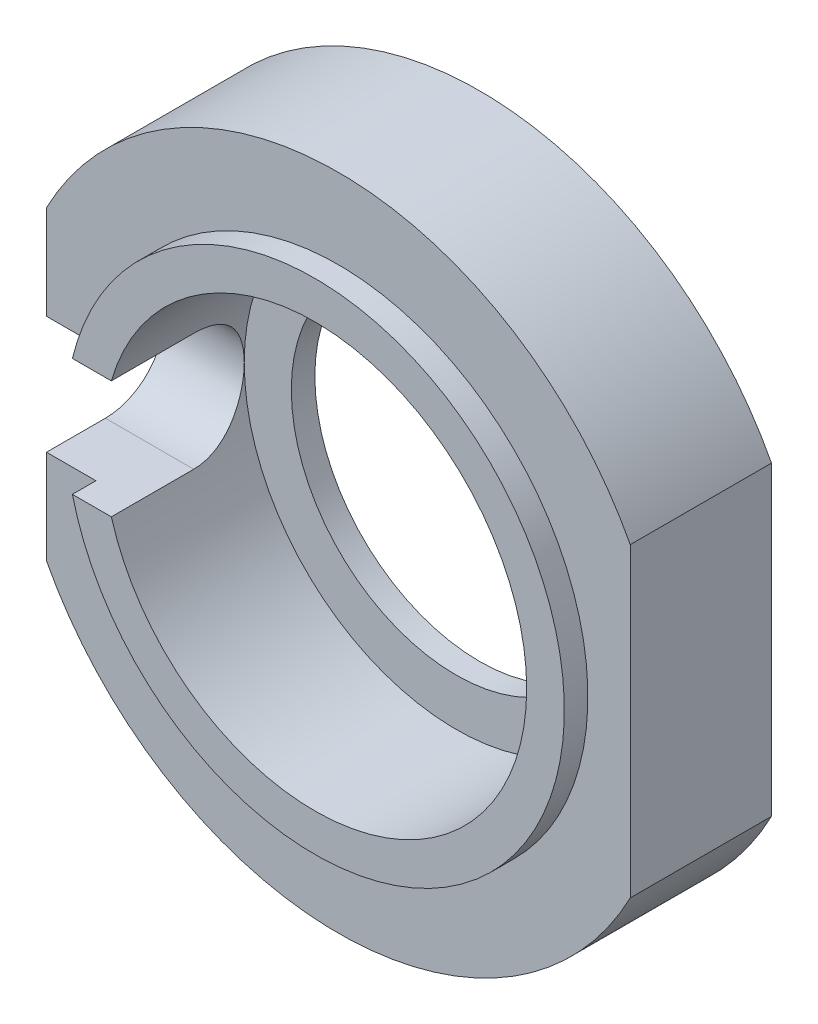
ISO-10303-21;
HEADER;
FILE_DESCRIPTION(('STEP AP214'),'2;1');
FILE_NAME('part.step','',(''),(''),'','','');
FILE_SCHEMA(('AUTOMOTIVE_DESIGN { 1 0 10303 214 1 1 1 1 }'));
ENDSEC;
DATA;
#1=APPLICATION_CONTEXT('core data for automotive mechanical design processes');
#2=APPLICATION_PROTOCOL_DEFINITION('international standard','automotive_design',2000,#1);
#3=PRODUCT_CONTEXT('',#1,'mechanical');
#4=PRODUCT('Part','Part','',(#3));
#5=PRODUCT_RELATED_PRODUCT_CATEGORY('part','',(#4));
#6=PRODUCT_DEFINITION_FORMATION('','',#4);
#7=PRODUCT_DEFINITION_CONTEXT('part definition',#1,'design');
#8=PRODUCT_DEFINITION('design','',#6,#7);
#9=PRODUCT_DEFINITION_SHAPE('','',#8);
#10=(LENGTH_UNIT() NAMED_UNIT(*) SI_UNIT(.MILLI.,.METRE.));
#11=(NAMED_UNIT(*) PLANE_ANGLE_UNIT() SI_UNIT($,.RADIAN.));
#12=(NAMED_UNIT(*) SI_UNIT($,.STERADIAN.) SOLID_ANGLE_UNIT());
#13=UNCERTAINTY_MEASURE_WITH_UNIT(LENGTH_MEASURE(1.E-05),#10,'distance_accuracy_value','');
#14=(GEOMETRIC_REPRESENTATION_CONTEXT(3) GLOBAL_UNCERTAINTY_ASSIGNED_CONTEXT((#13)) GLOBAL_UNIT_ASSIGNED_CONTEXT((#10,
#11,#12)) REPRESENTATION_CONTEXT('',''));
#15=CARTESIAN_POINT('',(0.,0.,0.));
#16=DIRECTION('',(0.,0.,1.));
#17=DIRECTION('',(1.,0.,0.));
#18=AXIS2_PLACEMENT_3D('',#15,#16,#17);
#19=CARTESIAN_POINT('',(0.,0.,-3.));
#20=DIRECTION('',(0.,0.,1.));
#21=DIRECTION('',(1.,0.,0.));
#22=AXIS2_PLACEMENT_3D('',#19,#20,#21);
#23=CYLINDRICAL_SURFACE('',#22,7.);
#24=DIRECTION('',(0.,0.,1.));
#25=VECTOR('',#24,1.);
#26=CARTESIAN_POINT('',(-6.2,3.24961536185439,-3.));
#27=LINE('',#26,#25);
#28=CARTESIAN_POINT('',(-6.2,3.24961536185439,0.));
#29=VERTEX_POINT('',#28);
#30=CARTESIAN_POINT('',(-6.2,3.24961536185439,-3.));
#31=VERTEX_POINT('',#30);
#32=EDGE_CURVE('E129',#29,#31,#27,.F.);
#33=ORIENTED_EDGE('',*,*,#32,.F.);
#34=CARTESIAN_POINT('',(0.,0.,0.));
#35=DIRECTION('',(0.,0.,1.));
#36=DIRECTION('',(1.,0.,0.));
#37=AXIS2_PLACEMENT_3D('',#34,#35,#36);
#38=CIRCLE('',#37,7.);
#39=CARTESIAN_POINT('',(6.2,3.24961536185438,0.));
#40=VERTEX_POINT('',#39);
#41=EDGE_CURVE('E165',#40,#29,#38,.T.);
#42=ORIENTED_EDGE('',*,*,#41,.F.);
#43=DIRECTION('',(0.,0.,1.));
#44=VECTOR('',#43,1.);
#45=CARTESIAN_POINT('',(6.2,3.24961536185438,-3.));
#46=LINE('',#45,#44);
#47=CARTESIAN_POINT('',(6.2,3.24961536185438,-3.));
#48=VERTEX_POINT('',#47);
#49=EDGE_CURVE('E73',#40,#48,#46,.F.);
#50=ORIENTED_EDGE('',*,*,#49,.T.);
#51=CARTESIAN_POINT('',(0.,0.,-3.));
#52=DIRECTION('',(0.,0.,1.));
#53=DIRECTION('',(1.,0.,0.));
#54=AXIS2_PLACEMENT_3D('',#51,#52,#53);
#55=CIRCLE('',#54,7.);
#56=EDGE_CURVE('E148',#48,#31,#55,.T.);
#57=ORIENTED_EDGE('',*,*,#56,.T.);
#58=EDGE_LOOP('',(#33,#42,#50,#57));
#59=FACE_BOUND('',#58,.T.);
#60=ADVANCED_FACE('F50',(#59),#23,.T.);
#61=DIRECTION('',(0.,0.,1.));
#62=VECTOR('',#61,1.);
#63=CARTESIAN_POINT('',(-6.2,-3.24961536185439,-3.));
#64=LINE('',#63,#62);
#65=CARTESIAN_POINT('',(-6.2,-3.24961536185438,-3.));
#66=VERTEX_POINT('',#65);
#67=CARTESIAN_POINT('',(-6.2,-3.24961536185438,0.));
#68=VERTEX_POINT('',#67);
#69=EDGE_CURVE('E141',#66,#68,#64,.T.);
#70=ORIENTED_EDGE('',*,*,#69,.F.);
#71=CARTESIAN_POINT('',(6.2,-3.24961536185439,-3.));
#72=VERTEX_POINT('',#71);
#73=EDGE_CURVE('E149',#66,#72,#55,.T.);
#74=ORIENTED_EDGE('',*,*,#73,.T.);
#75=DIRECTION('',(0.,0.,1.));
#76=VECTOR('',#75,1.);
#77=CARTESIAN_POINT('',(6.2,-3.24961536185439,-3.));
#78=LINE('',#77,#76);
#79=CARTESIAN_POINT('',(6.2,-3.24961536185439,0.));
#80=VERTEX_POINT('',#79);
#81=EDGE_CURVE('E222',#72,#80,#78,.T.);
#82=ORIENTED_EDGE('',*,*,#81,.T.);
#83=EDGE_CURVE('E156',#68,#80,#38,.T.);
#84=ORIENTED_EDGE('',*,*,#83,.F.);
#85=EDGE_LOOP('',(#70,#74,#82,#84));
#86=FACE_BOUND('',#85,.T.);
#87=ADVANCED_FACE('F255',(#86),#23,.T.);
#88=CARTESIAN_POINT('',(0.,0.,-3.));
#89=DIRECTION('',(0.,0.,1.));
#90=DIRECTION('',(1.,0.,0.));
#91=AXIS2_PLACEMENT_3D('',#88,#89,#90);
#92=PLANE('',#91);
#93=CARTESIAN_POINT('',(0.,0.,-3.));
#94=DIRECTION('',(0.,0.,-1.));
#95=DIRECTION('',(-1.,0.,0.));
#96=AXIS2_PLACEMENT_3D('',#93,#94,#95);
#97=CIRCLE('',#96,3.5);
#98=CARTESIAN_POINT('',(-3.5,0.,-3.));
#99=VERTEX_POINT('',#98);
#100=EDGE_CURVE('E181',#99,#99,#97,.T.);
#101=ORIENTED_EDGE('',*,*,#100,.F.);
#102=EDGE_LOOP('',(#101));
#103=FACE_BOUND('',#102,.T.);
#104=ORIENTED_EDGE('',*,*,#73,.F.);
#105=DIRECTION('',(0.,-1.,0.));
#106=VECTOR('',#105,1.);
#107=CARTESIAN_POINT('',(-6.2,12.06652293587,-3.));
#108=LINE('',#107,#106);
#109=EDGE_CURVE('E132',#31,#66,#108,.T.);
#110=ORIENTED_EDGE('',*,*,#109,.F.);
#111=ORIENTED_EDGE('',*,*,#56,.F.);
#112=DIRECTION('',(0.,-1.,0.));
#113=VECTOR('',#112,1.);
#114=CARTESIAN_POINT('',(6.2,12.7025152736224,-3.));
#115=LINE('',#114,#113);
#116=EDGE_CURVE('E140',#48,#72,#115,.T.);
#117=ORIENTED_EDGE('',*,*,#116,.T.);
#118=EDGE_LOOP('',(#104,#110,#111,#117));
#119=FACE_BOUND('',#118,.T.);
#120=ADVANCED_FACE('F146',(#103,#119),#92,.F.);
#121=CARTESIAN_POINT('',(0.,0.,0.));
#122=DIRECTION('',(0.,0.,1.));
#123=DIRECTION('',(1.,0.,0.));
#124=AXIS2_PLACEMENT_3D('',#121,#122,#123);
#125=PLANE('',#124);
#126=DIRECTION('',(0.,1.,0.));
#127=VECTOR('',#126,1.);
#128=CARTESIAN_POINT('',(-6.2,0.,0.));
#129=LINE('',#128,#127);
#130=CARTESIAN_POINT('',(-6.2,-1.25,0.));
#131=VERTEX_POINT('',#130);
#132=EDGE_CURVE('E226',#68,#131,#129,.T.);
#133=ORIENTED_EDGE('',*,*,#132,.F.);
#134=ORIENTED_EDGE('',*,*,#83,.T.);
#135=DIRECTION('',(0.,1.,0.));
#136=VECTOR('',#135,1.);
#137=CARTESIAN_POINT('',(6.2,0.,0.));
#138=LINE('',#137,#136);
#139=EDGE_CURVE('E59',#80,#40,#138,.T.);
#140=ORIENTED_EDGE('',*,*,#139,.T.);
#141=ORIENTED_EDGE('',*,*,#41,.T.);
#142=CARTESIAN_POINT('',(-6.2,1.25,0.));
#143=VERTEX_POINT('',#142);
#144=EDGE_CURVE('E135',#143,#29,#129,.T.);
#145=ORIENTED_EDGE('',*,*,#144,.F.);
#146=DIRECTION('',(-1.,0.,0.));
#147=VECTOR('',#146,1.);
#148=CARTESIAN_POINT('',(0.,1.25,0.));
#149=LINE('',#148,#147);
#150=CARTESIAN_POINT('',(-5.15048541401682,1.25,0.));
#151=VERTEX_POINT('',#150);
#152=EDGE_CURVE('E175',#151,#143,#149,.T.);
#153=ORIENTED_EDGE('',*,*,#152,.F.);
#154=CARTESIAN_POINT('',(0.,0.,0.));
#155=DIRECTION('',(0.,0.,1.));
#156=DIRECTION('',(1.,0.,0.));
#157=AXIS2_PLACEMENT_3D('',#154,#155,#156);
#158=CIRCLE('',#157,5.3);
#159=CARTESIAN_POINT('',(-5.15048541401682,-1.25,0.));
#160=VERTEX_POINT('',#159);
#161=EDGE_CURVE('E151',#160,#151,#158,.T.);
#162=ORIENTED_EDGE('',*,*,#161,.F.);
#163=DIRECTION('',(-1.,0.,0.));
#164=VECTOR('',#163,1.);
#165=CARTESIAN_POINT('',(0.,-1.25,0.));
#166=LINE('',#165,#164);
#167=EDGE_CURVE('E172',#160,#131,#166,.T.);
#168=ORIENTED_EDGE('',*,*,#167,.T.);
#169=EDGE_LOOP('',(#133,#134,#140,#141,#145,#153,#162,#168));
#170=FACE_BOUND('',#169,.T.);
#171=ADVANCED_FACE('F184',(#170),#125,.T.);
#172=CARTESIAN_POINT('',(0.,0.,0.5));
#173=DIRECTION('',(0.,0.,-1.));
#174=DIRECTION('',(-1.,0.,0.));
#175=AXIS2_PLACEMENT_3D('',#172,#173,#174);
#176=CYLINDRICAL_SURFACE('',#175,4.5);
#177=CARTESIAN_POINT('',(-4.32290411644765,-1.25,-1.25));
#178=CARTESIAN_POINT('',(-4.32290146436676,-1.250000576045,-1.28443902151534));
#179=CARTESIAN_POINT('',(-4.32331618408268,-1.24857583471195,-1.31886083039536));
#180=CARTESIAN_POINT('',(-4.32495310948487,-1.24289726955145,-1.3874442118807));
#181=CARTESIAN_POINT('',(-4.32617515519048,-1.23864400622614,-1.42160583468842));
#182=CARTESIAN_POINT('',(-4.33100149833611,-1.22170857228189,-1.5231684082525));
#183=CARTESIAN_POINT('',(-4.33576634319415,-1.20485043734851,-1.58986696249564));
#184=CARTESIAN_POINT('',(-4.34782862393349,-1.16056251821539,-1.71934348359845));
#185=CARTESIAN_POINT('',(-4.35512547838519,-1.13313516088422,-1.78212234664163));
#186=CARTESIAN_POINT('',(-4.37142497842244,-1.06852719338263,-1.90222678997382));
#187=CARTESIAN_POINT('',(-4.38042826125777,-1.03134293758884,-1.95955032096867));
#188=CARTESIAN_POINT('',(-4.39939714110305,-0.947208740400632,-2.0686303119187));
#189=CARTESIAN_POINT('',(-4.4093808433702,-0.900042882492583,-2.12021704718377));
#190=CARTESIAN_POINT('',(-4.42903068956963,-0.797744375711472,-2.21486290368673));
#191=CARTESIAN_POINT('',(-4.43869678111203,-0.742610420517771,-2.25792062389568));
#192=CARTESIAN_POINT('',(-4.4568262221146,-0.624748847501625,-2.33500318468976));
#193=CARTESIAN_POINT('',(-4.46526557805168,-0.561905279407677,-2.36885686402257));
#194=CARTESIAN_POINT('',(-4.47978037147462,-0.431147068581119,-2.42545066447839));
#195=CARTESIAN_POINT('',(-4.48585635069242,-0.363233592229249,-2.44819333276768));
#196=CARTESIAN_POINT('',(-4.49483154375068,-0.226043909478742,-2.48136530042189));
#197=CARTESIAN_POINT('',(-4.49780562679107,-0.156842976341786,-2.49208529277897));
#198=CARTESIAN_POINT('',(-4.50050434231718,-0.0175637350726412,-2.50182374718203));
#199=CARTESIAN_POINT('',(-4.50022949353404,0.0525144312139211,-2.50084407721993));
#200=CARTESIAN_POINT('',(-4.49651542268428,0.189527464729258,-2.48741219200865));
#201=CARTESIAN_POINT('',(-4.49316295627681,0.256495880174801,-2.47527449984516));
#202=CARTESIAN_POINT('',(-4.48377373992802,0.387404386211101,-2.4403811972799));
#203=CARTESIAN_POINT('',(-4.47773685771609,0.451344327406483,-2.41762506366747));
#204=CARTESIAN_POINT('',(-4.46353118905257,0.575167349566246,-2.36190872708191));
#205=CARTESIAN_POINT('',(-4.45534060663725,0.635000577901014,-2.32884351898761));
#206=CARTESIAN_POINT('',(-4.43770593865296,0.748373249601415,-2.25352937127713));
#207=CARTESIAN_POINT('',(-4.42826161351248,0.801911486391908,-2.211278675465));
#208=CARTESIAN_POINT('',(-4.40876934232228,0.903048023877687,-2.11714089157013));
#209=CARTESIAN_POINT('',(-4.39871176449087,0.950390721090147,-2.06498088801708));
#210=CARTESIAN_POINT('',(-4.37940385930509,1.03573266388548,-1.95334513077325));
#211=CARTESIAN_POINT('',(-4.37015375862718,1.07372929122919,-1.89386733403631));
#212=CARTESIAN_POINT('',(-4.35346480631467,1.13952154646574,-1.76868204304441));
#213=CARTESIAN_POINT('',(-4.34604045960407,1.16723631936365,-1.70293007972026));
#214=CARTESIAN_POINT('',(-4.33402454738315,1.21109743492695,-1.56747799244878));
#215=CARTESIAN_POINT('',(-4.329428707483,1.22726123919972,-1.49778400053626));
#216=CARTESIAN_POINT('',(-4.32533224221935,1.24157759886207,-1.39788311805461));
#217=CARTESIAN_POINT('',(-4.32442341010474,1.24473608920077,-1.36837911678992));
#218=CARTESIAN_POINT('',(-4.32320943811857,1.24894515709783,-1.30925491623904));
#219=CARTESIAN_POINT('',(-4.32290336202703,1.24999900369232,-1.2796349688701));
#220=CARTESIAN_POINT('',(-4.32290411644765,1.25,-1.25));
#221=B_SPLINE_CURVE_WITH_KNOTS('',3,(#177,#178,#179,#180,#181,#182,#183,#184,#185,#186,#187,
#188,#189,#190,#191,#192,#193,#194,#195,#196,#197,#198,#199,#200,#201,#202,#203,#204,#205,#206,
#207,#208,#209,#210,#211,#212,#213,#214,#215,#216,#217,#218,#219,#220),.UNSPECIFIED.,.F.,.F.,(4,
2,2,2,2,2,2,2,2,2,2,2,2,2,2,2,2,2,2,2,2,4),(0.,0.103251330397729,0.206482206525295,
0.412292932386806,0.618056428827713,0.823896917670529,1.03475400760892,1.24564570556978,
1.46022599591408,1.67475707125433,1.88398102562563,2.09317157532102,2.2966404702467,
2.50011939191108,2.70574260990256,2.91140517613004,3.12388242695943,3.33641913425316,
3.55059344766321,3.7644433047568,3.85343647289299,3.94229130462277),.UNSPECIFIED.);
#222=CARTESIAN_POINT('',(-4.50000000000113,4.31042943698656E-13,-2.50000000000406));
#223=VERTEX_POINT('',#222);
#224=CARTESIAN_POINT('',(-4.32290411644765,1.25,-1.25));
#225=VERTEX_POINT('',#224);
#226=EDGE_CURVE('E189',#223,#225,#221,.T.);
#227=ORIENTED_EDGE('',*,*,#226,.F.);
#228=CARTESIAN_POINT('',(0.,0.,-2.5));
#229=DIRECTION('',(0.,0.,-1.));
#230=DIRECTION('',(-1.,0.,0.));
#231=AXIS2_PLACEMENT_3D('',#228,#229,#230);
#232=CIRCLE('',#231,4.5);
#233=EDGE_CURVE('E180',#223,#223,#232,.T.);
#234=ORIENTED_EDGE('',*,*,#233,.T.);
#235=CARTESIAN_POINT('',(-4.32290411644765,-1.25,-1.25));
#236=VERTEX_POINT('',#235);
#237=EDGE_CURVE('E159',#236,#223,#221,.T.);
#238=ORIENTED_EDGE('',*,*,#237,.F.);
#239=DIRECTION('',(0.,0.,-1.));
#240=VECTOR('',#239,1.);
#241=CARTESIAN_POINT('',(-4.32290411644765,-1.25,0.5));
#242=LINE('',#241,#240);
#243=CARTESIAN_POINT('',(-4.32290411644765,-1.25,0.5));
#244=VERTEX_POINT('',#243);
#245=EDGE_CURVE('E205',#236,#244,#242,.F.);
#246=ORIENTED_EDGE('',*,*,#245,.T.);
#247=CARTESIAN_POINT('',(0.,0.,0.5));
#248=DIRECTION('',(0.,0.,1.));
#249=DIRECTION('',(1.,0.,0.));
#250=AXIS2_PLACEMENT_3D('',#247,#248,#249);
#251=CIRCLE('',#250,4.5);
#252=CARTESIAN_POINT('',(-4.32290411644765,1.25,0.5));
#253=VERTEX_POINT('',#252);
#254=EDGE_CURVE('E154',#244,#253,#251,.T.);
#255=ORIENTED_EDGE('',*,*,#254,.T.);
#256=DIRECTION('',(0.,0.,-1.));
#257=VECTOR('',#256,1.);
#258=CARTESIAN_POINT('',(-4.32290411644765,1.25,0.5));
#259=LINE('',#258,#257);
#260=EDGE_CURVE('E193',#225,#253,#259,.F.);
#261=ORIENTED_EDGE('',*,*,#260,.F.);
#262=EDGE_LOOP('',(#227,#234,#238,#246,#255,#261));
#263=FACE_BOUND('',#262,.T.);
#264=ADVANCED_FACE('F52',(#263),#176,.F.);
#265=CARTESIAN_POINT('',(0.,0.,0.5));
#266=DIRECTION('',(0.,0.,-1.));
#267=DIRECTION('',(-1.,0.,0.));
#268=AXIS2_PLACEMENT_3D('',#265,#266,#267);
#269=CYLINDRICAL_SURFACE('',#268,5.3);
#270=ORIENTED_EDGE('',*,*,#161,.T.);
#271=DIRECTION('',(0.,0.,-1.));
#272=VECTOR('',#271,1.);
#273=CARTESIAN_POINT('',(-5.15048541401682,1.25,0.5));
#274=LINE('',#273,#272);
#275=CARTESIAN_POINT('',(-5.15048541401682,1.25,0.5));
#276=VERTEX_POINT('',#275);
#277=EDGE_CURVE('E200',#151,#276,#274,.F.);
#278=ORIENTED_EDGE('',*,*,#277,.T.);
#279=CARTESIAN_POINT('',(0.,0.,0.5));
#280=DIRECTION('',(0.,0.,1.));
#281=DIRECTION('',(1.,0.,0.));
#282=AXIS2_PLACEMENT_3D('',#279,#280,#281);
#283=CIRCLE('',#282,5.3);
#284=CARTESIAN_POINT('',(-5.15048541401682,-1.25,0.5));
#285=VERTEX_POINT('',#284);
#286=EDGE_CURVE('E169',#285,#276,#283,.T.);
#287=ORIENTED_EDGE('',*,*,#286,.F.);
#288=DIRECTION('',(0.,0.,-1.));
#289=VECTOR('',#288,1.);
#290=CARTESIAN_POINT('',(-5.15048541401682,-1.25,0.5));
#291=LINE('',#290,#289);
#292=EDGE_CURVE('E211',#160,#285,#291,.F.);
#293=ORIENTED_EDGE('',*,*,#292,.F.);
#294=EDGE_LOOP('',(#270,#278,#287,#293));
#295=FACE_BOUND('',#294,.T.);
#296=ADVANCED_FACE('F266',(#295),#269,.T.);
#297=CARTESIAN_POINT('',(0.,0.,0.5));
#298=DIRECTION('',(0.,0.,1.));
#299=DIRECTION('',(1.,0.,0.));
#300=AXIS2_PLACEMENT_3D('',#297,#298,#299);
#301=PLANE('',#300);
#302=DIRECTION('',(-1.,0.,0.));
#303=VECTOR('',#302,1.);
#304=CARTESIAN_POINT('',(0.,1.25,0.5));
#305=LINE('',#304,#303);
#306=EDGE_CURVE('E197',#253,#276,#305,.T.);
#307=ORIENTED_EDGE('',*,*,#306,.F.);
#308=ORIENTED_EDGE('',*,*,#254,.F.);
#309=DIRECTION('',(-1.,0.,0.));
#310=VECTOR('',#309,1.);
#311=CARTESIAN_POINT('',(0.,-1.25,0.5));
#312=LINE('',#311,#310);
#313=EDGE_CURVE('E208',#244,#285,#312,.T.);
#314=ORIENTED_EDGE('',*,*,#313,.T.);
#315=ORIENTED_EDGE('',*,*,#286,.T.);
#316=EDGE_LOOP('',(#307,#308,#314,#315));
#317=FACE_BOUND('',#316,.T.);
#318=ADVANCED_FACE('F264',(#317),#301,.T.);
#319=CARTESIAN_POINT('',(-7.,1.25,-1.25));
#320=DIRECTION('',(0.,1.,0.));
#321=DIRECTION('',(0.,0.,1.));
#322=AXIS2_PLACEMENT_3D('',#319,#320,#321);
#323=PLANE('',#322);
#324=ORIENTED_EDGE('',*,*,#152,.T.);
#325=DIRECTION('',(0.,0.,-1.));
#326=VECTOR('',#325,1.);
#327=CARTESIAN_POINT('',(-6.2,1.25,-1.25));
#328=LINE('',#327,#326);
#329=CARTESIAN_POINT('',(-6.2,1.25,-1.25));
#330=VERTEX_POINT('',#329);
#331=EDGE_CURVE('E228',#143,#330,#328,.T.);
#332=ORIENTED_EDGE('',*,*,#331,.T.);
#333=DIRECTION('',(1.,0.,0.));
#334=VECTOR('',#333,1.);
#335=CARTESIAN_POINT('',(-7.,1.25,-1.25));
#336=LINE('',#335,#334);
#337=EDGE_CURVE('E215',#330,#225,#336,.T.);
#338=ORIENTED_EDGE('',*,*,#337,.T.);
#339=ORIENTED_EDGE('',*,*,#260,.T.);
#340=ORIENTED_EDGE('',*,*,#306,.T.);
#341=ORIENTED_EDGE('',*,*,#277,.F.);
#342=EDGE_LOOP('',(#324,#332,#338,#339,#340,#341));
#343=FACE_BOUND('',#342,.T.);
#344=ADVANCED_FACE('F231',(#343),#323,.F.);
#345=CARTESIAN_POINT('',(-7.,-1.25,-1.25));
#346=DIRECTION('',(0.,1.,0.));
#347=DIRECTION('',(0.,0.,1.));
#348=AXIS2_PLACEMENT_3D('',#345,#346,#347);
#349=PLANE('',#348);
#350=DIRECTION('',(0.,0.,-1.));
#351=VECTOR('',#350,1.);
#352=CARTESIAN_POINT('',(-6.2,-1.25,-1.25));
#353=LINE('',#352,#351);
#354=CARTESIAN_POINT('',(-6.2,-1.25,-1.25));
#355=VERTEX_POINT('',#354);
#356=EDGE_CURVE('E66',#131,#355,#353,.T.);
#357=ORIENTED_EDGE('',*,*,#356,.F.);
#358=ORIENTED_EDGE('',*,*,#167,.F.);
#359=ORIENTED_EDGE('',*,*,#292,.T.);
#360=ORIENTED_EDGE('',*,*,#313,.F.);
#361=ORIENTED_EDGE('',*,*,#245,.F.);
#362=DIRECTION('',(1.,0.,0.));
#363=VECTOR('',#362,1.);
#364=CARTESIAN_POINT('',(-7.,-1.25,-1.25));
#365=LINE('',#364,#363);
#366=EDGE_CURVE('E213',#355,#236,#365,.T.);
#367=ORIENTED_EDGE('',*,*,#366,.F.);
#368=EDGE_LOOP('',(#357,#358,#359,#360,#361,#367));
#369=FACE_BOUND('',#368,.T.);
#370=ADVANCED_FACE('F237',(#369),#349,.T.);
#371=CARTESIAN_POINT('',(-7.,0.,-1.25));
#372=DIRECTION('',(1.,0.,0.));
#373=DIRECTION('',(0.,0.,-1.));
#374=AXIS2_PLACEMENT_3D('',#371,#372,#373);
#375=CYLINDRICAL_SURFACE('',#374,1.25);
#376=ORIENTED_EDGE('',*,*,#337,.F.);
#377=CARTESIAN_POINT('',(-6.2,0.,-1.25));
#378=DIRECTION('',(1.,0.,0.));
#379=DIRECTION('',(0.,1.,0.));
#380=AXIS2_PLACEMENT_3D('',#377,#378,#379);
#381=CIRCLE('',#380,1.25);
#382=EDGE_CURVE('E12',#330,#355,#381,.F.);
#383=ORIENTED_EDGE('',*,*,#382,.T.);
#384=ORIENTED_EDGE('',*,*,#366,.T.);
#385=ORIENTED_EDGE('',*,*,#237,.T.);
#386=ORIENTED_EDGE('',*,*,#226,.T.);
#387=EDGE_LOOP('',(#376,#383,#384,#385,#386));
#388=FACE_BOUND('',#387,.T.);
#389=ADVANCED_FACE('F233',(#388),#375,.F.);
#390=CARTESIAN_POINT('',(0.,0.,-2.5));
#391=DIRECTION('',(0.,0.,-1.));
#392=DIRECTION('',(-1.,0.,0.));
#393=AXIS2_PLACEMENT_3D('',#390,#391,#392);
#394=PLANE('',#393);
#395=CARTESIAN_POINT('',(0.,0.,-2.5));
#396=DIRECTION('',(0.,0.,-1.));
#397=DIRECTION('',(-1.,0.,0.));
#398=AXIS2_PLACEMENT_3D('',#395,#396,#397);
#399=CIRCLE('',#398,3.5);
#400=CARTESIAN_POINT('',(-3.5,0.,-2.5));
#401=VERTEX_POINT('',#400);
#402=EDGE_CURVE('E178',#401,#401,#399,.T.);
#403=ORIENTED_EDGE('',*,*,#402,.T.);
#404=EDGE_LOOP('',(#403));
#405=FACE_BOUND('',#404,.T.);
#406=ORIENTED_EDGE('',*,*,#233,.F.);
#407=EDGE_LOOP('',(#406));
#408=FACE_BOUND('',#407,.T.);
#409=ADVANCED_FACE('F241',(#405,#408),#394,.F.);
#410=CARTESIAN_POINT('',(0.,0.,0.5));
#411=DIRECTION('',(0.,0.,-1.));
#412=DIRECTION('',(-1.,0.,0.));
#413=AXIS2_PLACEMENT_3D('',#410,#411,#412);
#414=CYLINDRICAL_SURFACE('',#413,3.5);
#415=ORIENTED_EDGE('',*,*,#100,.T.);
#416=EDGE_LOOP('',(#415));
#417=FACE_BOUND('',#416,.T.);
#418=ORIENTED_EDGE('',*,*,#402,.F.);
#419=EDGE_LOOP('',(#418));
#420=FACE_BOUND('',#419,.T.);
#421=ADVANCED_FACE('F243',(#417,#420),#414,.F.);
#422=CARTESIAN_POINT('',(6.2,12.7025152736224,0.5));
#423=DIRECTION('',(1.,0.,0.));
#424=DIRECTION('',(0.,1.,0.));
#425=AXIS2_PLACEMENT_3D('',#422,#423,#424);
#426=PLANE('',#425);
#427=ORIENTED_EDGE('',*,*,#139,.F.);
#428=ORIENTED_EDGE('',*,*,#81,.F.);
#429=ORIENTED_EDGE('',*,*,#116,.F.);
#430=ORIENTED_EDGE('',*,*,#49,.F.);
#431=EDGE_LOOP('',(#427,#428,#429,#430));
#432=FACE_BOUND('',#431,.T.);
#433=ADVANCED_FACE('F250',(#432),#426,.T.);
#434=CARTESIAN_POINT('',(-6.2,12.06652293587,0.5));
#435=DIRECTION('',(1.,0.,0.));
#436=DIRECTION('',(0.,1.,0.));
#437=AXIS2_PLACEMENT_3D('',#434,#435,#436);
#438=PLANE('',#437);
#439=ORIENTED_EDGE('',*,*,#32,.T.);
#440=ORIENTED_EDGE('',*,*,#109,.T.);
#441=ORIENTED_EDGE('',*,*,#69,.T.);
#442=ORIENTED_EDGE('',*,*,#132,.T.);
#443=ORIENTED_EDGE('',*,*,#356,.T.);
#444=ORIENTED_EDGE('',*,*,#382,.F.);
#445=ORIENTED_EDGE('',*,*,#331,.F.);
#446=ORIENTED_EDGE('',*,*,#144,.T.);
#447=EDGE_LOOP('',(#439,#440,#441,#442,#443,#444,#445,#446));
#448=FACE_BOUND('',#447,.T.);
#449=ADVANCED_FACE('F131',(#448),#438,.F.);
#450=CLOSED_SHELL('',(#60,#87,#120,#171,#264,#296,#318,#344,#370,#389,#409,#421,#433,#449));
#451=MANIFOLD_SOLID_BREP('B2',#450);
#452=ADVANCED_BREP_SHAPE_REPRESENTATION('',(#18,#451),#14);
#453=SHAPE_DEFINITION_REPRESENTATION(#9,#452);
ENDSEC;
END-ISO-10303-21;
